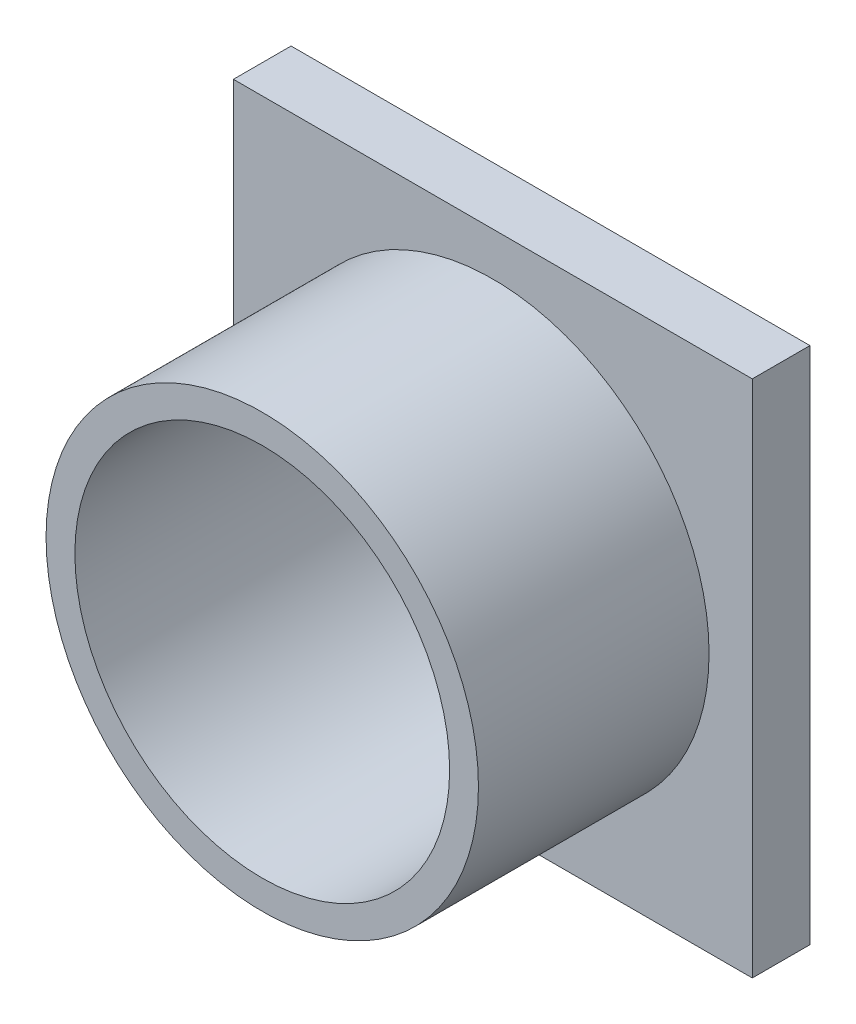
ISO-10303-21;
HEADER;
FILE_DESCRIPTION(('STEP AP214'),'2;1');
FILE_NAME('part.step','',(''),(''),'','','');
FILE_SCHEMA(('AUTOMOTIVE_DESIGN { 1 0 10303 214 1 1 1 1 }'));
ENDSEC;
DATA;
#1=APPLICATION_CONTEXT('core data for automotive mechanical design processes');
#2=APPLICATION_PROTOCOL_DEFINITION('international standard','automotive_design',2000,#1);
#3=PRODUCT_CONTEXT('',#1,'mechanical');
#4=PRODUCT('Part','Part','',(#3));
#5=PRODUCT_RELATED_PRODUCT_CATEGORY('part','',(#4));
#6=PRODUCT_DEFINITION_FORMATION('','',#4);
#7=PRODUCT_DEFINITION_CONTEXT('part definition',#1,'design');
#8=PRODUCT_DEFINITION('design','',#6,#7);
#9=PRODUCT_DEFINITION_SHAPE('','',#8);
#10=(LENGTH_UNIT() NAMED_UNIT(*) SI_UNIT(.MILLI.,.METRE.));
#11=(NAMED_UNIT(*) PLANE_ANGLE_UNIT() SI_UNIT($,.RADIAN.));
#12=(NAMED_UNIT(*) SI_UNIT($,.STERADIAN.) SOLID_ANGLE_UNIT());
#13=UNCERTAINTY_MEASURE_WITH_UNIT(LENGTH_MEASURE(1.E-05),#10,'distance_accuracy_value','');
#14=(GEOMETRIC_REPRESENTATION_CONTEXT(3) GLOBAL_UNCERTAINTY_ASSIGNED_CONTEXT((#13)) GLOBAL_UNIT_ASSIGNED_CONTEXT((#10,
#11,#12)) REPRESENTATION_CONTEXT('',''));
#15=CARTESIAN_POINT('',(0.,0.,0.));
#16=DIRECTION('',(0.,0.,1.));
#17=DIRECTION('',(1.,0.,0.));
#18=AXIS2_PLACEMENT_3D('',#15,#16,#17);
#19=CARTESIAN_POINT('',(0.,0.,0.));
#20=DIRECTION('',(0.,0.,1.));
#21=DIRECTION('',(1.,0.,0.));
#22=AXIS2_PLACEMENT_3D('',#19,#20,#21);
#23=PLANE('',#22);
#24=DIRECTION('',(-1.,0.,0.));
#25=VECTOR('',#24,1.);
#26=CARTESIAN_POINT('',(18.8,-18.8,0.));
#27=LINE('',#26,#25);
#28=CARTESIAN_POINT('',(18.8,-18.8,0.));
#29=VERTEX_POINT('',#28);
#30=CARTESIAN_POINT('',(14.,-18.8,0.));
#31=VERTEX_POINT('',#30);
#32=EDGE_CURVE('E227',#29,#31,#27,.T.);
#33=ORIENTED_EDGE('',*,*,#32,.F.);
#34=DIRECTION('',(0.,-1.,0.));
#35=VECTOR('',#34,1.);
#36=CARTESIAN_POINT('',(18.8,-18.8,0.));
#37=LINE('',#36,#35);
#38=CARTESIAN_POINT('',(18.8,-15.,0.));
#39=VERTEX_POINT('',#38);
#40=EDGE_CURVE('E217',#39,#29,#37,.T.);
#41=ORIENTED_EDGE('',*,*,#40,.F.);
#42=DIRECTION('',(1.,0.,0.));
#43=VECTOR('',#42,1.);
#44=CARTESIAN_POINT('',(18.8,-15.,0.));
#45=LINE('',#44,#43);
#46=CARTESIAN_POINT('',(14.,-15.,0.));
#47=VERTEX_POINT('',#46);
#48=EDGE_CURVE('E220',#47,#39,#45,.T.);
#49=ORIENTED_EDGE('',*,*,#48,.F.);
#50=DIRECTION('',(0.,1.,0.));
#51=VECTOR('',#50,1.);
#52=CARTESIAN_POINT('',(14.,-18.8,0.));
#53=LINE('',#52,#51);
#54=EDGE_CURVE('E224',#31,#47,#53,.T.);
#55=ORIENTED_EDGE('',*,*,#54,.F.);
#56=EDGE_LOOP('',(#33,#41,#49,#55));
#57=FACE_BOUND('',#56,.T.);
#58=DIRECTION('',(0.,1.,0.));
#59=VECTOR('',#58,1.);
#60=CARTESIAN_POINT('',(14.,18.8,0.));
#61=LINE('',#60,#59);
#62=CARTESIAN_POINT('',(14.,15.,0.));
#63=VERTEX_POINT('',#62);
#64=CARTESIAN_POINT('',(14.,18.8,0.));
#65=VERTEX_POINT('',#64);
#66=EDGE_CURVE('E263',#63,#65,#61,.T.);
#67=ORIENTED_EDGE('',*,*,#66,.F.);
#68=DIRECTION('',(-1.,0.,0.));
#69=VECTOR('',#68,1.);
#70=CARTESIAN_POINT('',(18.8,15.,0.));
#71=LINE('',#70,#69);
#72=CARTESIAN_POINT('',(18.8,15.,0.));
#73=VERTEX_POINT('',#72);
#74=EDGE_CURVE('E275',#73,#63,#71,.T.);
#75=ORIENTED_EDGE('',*,*,#74,.F.);
#76=DIRECTION('',(0.,-1.,0.));
#77=VECTOR('',#76,1.);
#78=CARTESIAN_POINT('',(18.8,18.8,0.));
#79=LINE('',#78,#77);
#80=CARTESIAN_POINT('',(18.8,18.8,0.));
#81=VERTEX_POINT('',#80);
#82=EDGE_CURVE('E287',#81,#73,#79,.T.);
#83=ORIENTED_EDGE('',*,*,#82,.F.);
#84=DIRECTION('',(1.,0.,0.));
#85=VECTOR('',#84,1.);
#86=CARTESIAN_POINT('',(18.8,18.8,0.));
#87=LINE('',#86,#85);
#88=EDGE_CURVE('E284',#65,#81,#87,.T.);
#89=ORIENTED_EDGE('',*,*,#88,.F.);
#90=EDGE_LOOP('',(#67,#75,#83,#89));
#91=FACE_BOUND('',#90,.T.);
#92=DIRECTION('',(0.,1.,0.));
#93=VECTOR('',#92,1.);
#94=CARTESIAN_POINT('',(22.5,22.5,0.));
#95=LINE('',#94,#93);
#96=CARTESIAN_POINT('',(22.5,-22.5,0.));
#97=VERTEX_POINT('',#96);
#98=CARTESIAN_POINT('',(22.5,22.5,0.));
#99=VERTEX_POINT('',#98);
#100=EDGE_CURVE('E315',#97,#99,#95,.T.);
#101=ORIENTED_EDGE('',*,*,#100,.F.);
#102=DIRECTION('',(1.,0.,0.));
#103=VECTOR('',#102,1.);
#104=CARTESIAN_POINT('',(-22.5,-22.5,0.));
#105=LINE('',#104,#103);
#106=CARTESIAN_POINT('',(-22.5,-22.5,0.));
#107=VERTEX_POINT('',#106);
#108=EDGE_CURVE('E320',#107,#97,#105,.T.);
#109=ORIENTED_EDGE('',*,*,#108,.F.);
#110=DIRECTION('',(0.,-1.,0.));
#111=VECTOR('',#110,1.);
#112=CARTESIAN_POINT('',(-22.5,22.5,0.));
#113=LINE('',#112,#111);
#114=CARTESIAN_POINT('',(-22.5,22.5,0.));
#115=VERTEX_POINT('',#114);
#116=EDGE_CURVE('E331',#115,#107,#113,.T.);
#117=ORIENTED_EDGE('',*,*,#116,.F.);
#118=DIRECTION('',(-1.,0.,0.));
#119=VECTOR('',#118,1.);
#120=CARTESIAN_POINT('',(-22.5,22.5,0.));
#121=LINE('',#120,#119);
#122=EDGE_CURVE('E329',#99,#115,#121,.T.);
#123=ORIENTED_EDGE('',*,*,#122,.F.);
#124=EDGE_LOOP('',(#101,#109,#117,#123));
#125=FACE_BOUND('',#124,.T.);
#126=CARTESIAN_POINT('',(0.,0.,0.));
#127=DIRECTION('',(0.,0.,1.));
#128=DIRECTION('',(1.,0.,0.));
#129=AXIS2_PLACEMENT_3D('',#126,#127,#128);
#130=CIRCLE('',#129,16.25);
#131=CARTESIAN_POINT('',(16.25,0.,0.));
#132=VERTEX_POINT('',#131);
#133=EDGE_CURVE('E310',#132,#132,#130,.T.);
#134=ORIENTED_EDGE('',*,*,#133,.T.);
#135=EDGE_LOOP('',(#134));
#136=FACE_BOUND('',#135,.T.);
#137=DIRECTION('',(1.,0.,0.));
#138=VECTOR('',#137,1.);
#139=CARTESIAN_POINT('',(-18.8,18.8,0.));
#140=LINE('',#139,#138);
#141=CARTESIAN_POINT('',(-18.8,18.8,0.));
#142=VERTEX_POINT('',#141);
#143=CARTESIAN_POINT('',(-14.,18.8,0.));
#144=VERTEX_POINT('',#143);
#145=EDGE_CURVE('E260',#142,#144,#140,.T.);
#146=ORIENTED_EDGE('',*,*,#145,.F.);
#147=DIRECTION('',(0.,1.,0.));
#148=VECTOR('',#147,1.);
#149=CARTESIAN_POINT('',(-18.8,18.8,0.));
#150=LINE('',#149,#148);
#151=CARTESIAN_POINT('',(-18.8,15.,0.));
#152=VERTEX_POINT('',#151);
#153=EDGE_CURVE('E250',#152,#142,#150,.T.);
#154=ORIENTED_EDGE('',*,*,#153,.F.);
#155=DIRECTION('',(-1.,0.,0.));
#156=VECTOR('',#155,1.);
#157=CARTESIAN_POINT('',(-18.8,15.,0.));
#158=LINE('',#157,#156);
#159=CARTESIAN_POINT('',(-14.,15.,0.));
#160=VERTEX_POINT('',#159);
#161=EDGE_CURVE('E253',#160,#152,#158,.T.);
#162=ORIENTED_EDGE('',*,*,#161,.F.);
#163=DIRECTION('',(0.,-1.,0.));
#164=VECTOR('',#163,1.);
#165=CARTESIAN_POINT('',(-14.,18.8,0.));
#166=LINE('',#165,#164);
#167=EDGE_CURVE('E257',#144,#160,#166,.T.);
#168=ORIENTED_EDGE('',*,*,#167,.F.);
#169=EDGE_LOOP('',(#146,#154,#162,#168));
#170=FACE_BOUND('',#169,.T.);
#171=DIRECTION('',(0.,1.,0.));
#172=VECTOR('',#171,1.);
#173=CARTESIAN_POINT('',(-18.8,-18.8,0.));
#174=LINE('',#173,#172);
#175=CARTESIAN_POINT('',(-18.8,-18.8,0.));
#176=VERTEX_POINT('',#175);
#177=CARTESIAN_POINT('',(-18.8,-15.,0.));
#178=VERTEX_POINT('',#177);
#179=EDGE_CURVE('E170',#176,#178,#174,.T.);
#180=ORIENTED_EDGE('',*,*,#179,.F.);
#181=DIRECTION('',(-1.,0.,0.));
#182=VECTOR('',#181,1.);
#183=CARTESIAN_POINT('',(-18.8,-18.8,0.));
#184=LINE('',#183,#182);
#185=CARTESIAN_POINT('',(-14.,-18.8,0.));
#186=VERTEX_POINT('',#185);
#187=EDGE_CURVE('E172',#186,#176,#184,.T.);
#188=ORIENTED_EDGE('',*,*,#187,.F.);
#189=DIRECTION('',(0.,-1.,0.));
#190=VECTOR('',#189,1.);
#191=CARTESIAN_POINT('',(-14.,-18.8,0.));
#192=LINE('',#191,#190);
#193=CARTESIAN_POINT('',(-14.,-15.,0.));
#194=VERTEX_POINT('',#193);
#195=EDGE_CURVE('E57',#194,#186,#192,.T.);
#196=ORIENTED_EDGE('',*,*,#195,.F.);
#197=DIRECTION('',(1.,0.,0.));
#198=VECTOR('',#197,1.);
#199=CARTESIAN_POINT('',(-18.8,-15.,0.));
#200=LINE('',#199,#198);
#201=EDGE_CURVE('E52',#178,#194,#200,.T.);
#202=ORIENTED_EDGE('',*,*,#201,.F.);
#203=EDGE_LOOP('',(#180,#188,#196,#202));
#204=FACE_BOUND('',#203,.T.);
#205=ADVANCED_FACE('F37',(#57,#91,#125,#136,#170,#204),#23,.F.);
#206=CARTESIAN_POINT('',(0.,0.,5.));
#207=DIRECTION('',(0.,0.,1.));
#208=DIRECTION('',(1.,0.,0.));
#209=AXIS2_PLACEMENT_3D('',#206,#207,#208);
#210=PLANE('',#209);
#211=DIRECTION('',(0.,1.,0.));
#212=VECTOR('',#211,1.);
#213=CARTESIAN_POINT('',(22.5,22.5,5.));
#214=LINE('',#213,#212);
#215=CARTESIAN_POINT('',(22.5,-22.5,5.));
#216=VERTEX_POINT('',#215);
#217=CARTESIAN_POINT('',(22.5,22.5,5.));
#218=VERTEX_POINT('',#217);
#219=EDGE_CURVE('E316',#216,#218,#214,.T.);
#220=ORIENTED_EDGE('',*,*,#219,.T.);
#221=DIRECTION('',(-1.,0.,0.));
#222=VECTOR('',#221,1.);
#223=CARTESIAN_POINT('',(-22.5,22.5,5.));
#224=LINE('',#223,#222);
#225=CARTESIAN_POINT('',(-22.5,22.5,5.));
#226=VERTEX_POINT('',#225);
#227=EDGE_CURVE('E319',#218,#226,#224,.T.);
#228=ORIENTED_EDGE('',*,*,#227,.T.);
#229=DIRECTION('',(0.,-1.,0.));
#230=VECTOR('',#229,1.);
#231=CARTESIAN_POINT('',(-22.5,22.5,5.));
#232=LINE('',#231,#230);
#233=CARTESIAN_POINT('',(-22.5,-22.5,5.));
#234=VERTEX_POINT('',#233);
#235=EDGE_CURVE('E322',#226,#234,#232,.T.);
#236=ORIENTED_EDGE('',*,*,#235,.T.);
#237=DIRECTION('',(1.,0.,0.));
#238=VECTOR('',#237,1.);
#239=CARTESIAN_POINT('',(-22.5,-22.5,5.));
#240=LINE('',#239,#238);
#241=EDGE_CURVE('E324',#234,#216,#240,.T.);
#242=ORIENTED_EDGE('',*,*,#241,.T.);
#243=EDGE_LOOP('',(#220,#228,#236,#242));
#244=FACE_BOUND('',#243,.T.);
#245=CARTESIAN_POINT('',(0.,0.,5.));
#246=DIRECTION('',(0.,0.,1.));
#247=DIRECTION('',(1.,0.,0.));
#248=AXIS2_PLACEMENT_3D('',#245,#246,#247);
#249=CIRCLE('',#248,18.75);
#250=CARTESIAN_POINT('',(18.75,0.,5.));
#251=VERTEX_POINT('',#250);
#252=EDGE_CURVE('E306',#251,#251,#249,.T.);
#253=ORIENTED_EDGE('',*,*,#252,.F.);
#254=EDGE_LOOP('',(#253));
#255=FACE_BOUND('',#254,.T.);
#256=ADVANCED_FACE('F358',(#244,#255),#210,.T.);
#257=CARTESIAN_POINT('',(22.5,22.5,5.));
#258=DIRECTION('',(-1.,0.,0.));
#259=DIRECTION('',(0.,-1.,0.));
#260=AXIS2_PLACEMENT_3D('',#257,#258,#259);
#261=PLANE('',#260);
#262=ORIENTED_EDGE('',*,*,#100,.T.);
#263=DIRECTION('',(0.,0.,-1.));
#264=VECTOR('',#263,1.);
#265=CARTESIAN_POINT('',(22.5,22.5,5.));
#266=LINE('',#265,#264);
#267=EDGE_CURVE('E11',#218,#99,#266,.T.);
#268=ORIENTED_EDGE('',*,*,#267,.F.);
#269=ORIENTED_EDGE('',*,*,#219,.F.);
#270=DIRECTION('',(0.,0.,-1.));
#271=VECTOR('',#270,1.);
#272=CARTESIAN_POINT('',(22.5,-22.5,5.));
#273=LINE('',#272,#271);
#274=EDGE_CURVE('E326',#216,#97,#273,.T.);
#275=ORIENTED_EDGE('',*,*,#274,.T.);
#276=EDGE_LOOP('',(#262,#268,#269,#275));
#277=FACE_BOUND('',#276,.T.);
#278=ADVANCED_FACE('F39',(#277),#261,.F.);
#279=CARTESIAN_POINT('',(-22.5,22.5,5.));
#280=DIRECTION('',(0.,-1.,0.));
#281=DIRECTION('',(0.,0.,-1.));
#282=AXIS2_PLACEMENT_3D('',#279,#280,#281);
#283=PLANE('',#282);
#284=ORIENTED_EDGE('',*,*,#122,.T.);
#285=DIRECTION('',(0.,0.,-1.));
#286=VECTOR('',#285,1.);
#287=CARTESIAN_POINT('',(-22.5,22.5,5.));
#288=LINE('',#287,#286);
#289=EDGE_CURVE('E45',#226,#115,#288,.T.);
#290=ORIENTED_EDGE('',*,*,#289,.F.);
#291=ORIENTED_EDGE('',*,*,#227,.F.);
#292=ORIENTED_EDGE('',*,*,#267,.T.);
#293=EDGE_LOOP('',(#284,#290,#291,#292));
#294=FACE_BOUND('',#293,.T.);
#295=ADVANCED_FACE('F360',(#294),#283,.F.);
#296=CARTESIAN_POINT('',(-22.5,22.5,5.));
#297=DIRECTION('',(1.,0.,0.));
#298=DIRECTION('',(0.,1.,0.));
#299=AXIS2_PLACEMENT_3D('',#296,#297,#298);
#300=PLANE('',#299);
#301=ORIENTED_EDGE('',*,*,#116,.T.);
#302=DIRECTION('',(0.,0.,-1.));
#303=VECTOR('',#302,1.);
#304=CARTESIAN_POINT('',(-22.5,-22.5,5.));
#305=LINE('',#304,#303);
#306=EDGE_CURVE('E336',#234,#107,#305,.T.);
#307=ORIENTED_EDGE('',*,*,#306,.F.);
#308=ORIENTED_EDGE('',*,*,#235,.F.);
#309=ORIENTED_EDGE('',*,*,#289,.T.);
#310=EDGE_LOOP('',(#301,#307,#308,#309));
#311=FACE_BOUND('',#310,.T.);
#312=ADVANCED_FACE('F343',(#311),#300,.F.);
#313=CARTESIAN_POINT('',(-22.5,-22.5,5.));
#314=DIRECTION('',(0.,1.,0.));
#315=DIRECTION('',(0.,0.,1.));
#316=AXIS2_PLACEMENT_3D('',#313,#314,#315);
#317=PLANE('',#316);
#318=ORIENTED_EDGE('',*,*,#108,.T.);
#319=ORIENTED_EDGE('',*,*,#274,.F.);
#320=ORIENTED_EDGE('',*,*,#241,.F.);
#321=ORIENTED_EDGE('',*,*,#306,.T.);
#322=EDGE_LOOP('',(#318,#319,#320,#321));
#323=FACE_BOUND('',#322,.T.);
#324=ADVANCED_FACE('F352',(#323),#317,.F.);
#325=CARTESIAN_POINT('',(0.,0.,5.));
#326=DIRECTION('',(0.,0.,-1.));
#327=DIRECTION('',(-1.,0.,0.));
#328=AXIS2_PLACEMENT_3D('',#325,#326,#327);
#329=CYLINDRICAL_SURFACE('',#328,16.25);
#330=ORIENTED_EDGE('',*,*,#133,.F.);
#331=EDGE_LOOP('',(#330));
#332=FACE_BOUND('',#331,.T.);
#333=CARTESIAN_POINT('',(0.,0.,25.));
#334=DIRECTION('',(0.,0.,1.));
#335=DIRECTION('',(1.,0.,0.));
#336=AXIS2_PLACEMENT_3D('',#333,#334,#335);
#337=CIRCLE('',#336,16.25);
#338=CARTESIAN_POINT('',(16.25,0.,25.));
#339=VERTEX_POINT('',#338);
#340=EDGE_CURVE('E303',#339,#339,#337,.T.);
#341=ORIENTED_EDGE('',*,*,#340,.T.);
#342=EDGE_LOOP('',(#341));
#343=FACE_BOUND('',#342,.T.);
#344=ADVANCED_FACE('F378',(#332,#343),#329,.F.);
#345=CARTESIAN_POINT('',(0.,0.,25.));
#346=DIRECTION('',(0.,0.,1.));
#347=DIRECTION('',(1.,0.,0.));
#348=AXIS2_PLACEMENT_3D('',#345,#346,#347);
#349=PLANE('',#348);
#350=CARTESIAN_POINT('',(0.,0.,25.));
#351=DIRECTION('',(0.,0.,1.));
#352=DIRECTION('',(1.,0.,0.));
#353=AXIS2_PLACEMENT_3D('',#350,#351,#352);
#354=CIRCLE('',#353,18.75);
#355=CARTESIAN_POINT('',(18.75,0.,25.));
#356=VERTEX_POINT('',#355);
#357=EDGE_CURVE('E307',#356,#356,#354,.T.);
#358=ORIENTED_EDGE('',*,*,#357,.T.);
#359=EDGE_LOOP('',(#358));
#360=FACE_BOUND('',#359,.T.);
#361=ORIENTED_EDGE('',*,*,#340,.F.);
#362=EDGE_LOOP('',(#361));
#363=FACE_BOUND('',#362,.T.);
#364=ADVANCED_FACE('F382',(#360,#363),#349,.T.);
#365=CARTESIAN_POINT('',(0.,0.,25.));
#366=DIRECTION('',(0.,0.,-1.));
#367=DIRECTION('',(-1.,0.,0.));
#368=AXIS2_PLACEMENT_3D('',#365,#366,#367);
#369=CYLINDRICAL_SURFACE('',#368,18.75);
#370=ORIENTED_EDGE('',*,*,#357,.F.);
#371=EDGE_LOOP('',(#370));
#372=FACE_BOUND('',#371,.T.);
#373=ORIENTED_EDGE('',*,*,#252,.T.);
#374=EDGE_LOOP('',(#373));
#375=FACE_BOUND('',#374,.T.);
#376=ADVANCED_FACE('F387',(#372,#375),#369,.T.);
#377=CARTESIAN_POINT('',(14.,18.8,-3.));
#378=DIRECTION('',(1.,0.,0.));
#379=DIRECTION('',(0.,0.,-1.));
#380=AXIS2_PLACEMENT_3D('',#377,#378,#379);
#381=PLANE('',#380);
#382=ORIENTED_EDGE('',*,*,#66,.T.);
#383=DIRECTION('',(0.,0.,1.));
#384=VECTOR('',#383,1.);
#385=CARTESIAN_POINT('',(14.,18.8,-3.));
#386=LINE('',#385,#384);
#387=CARTESIAN_POINT('',(14.,18.8,-3.));
#388=VERTEX_POINT('',#387);
#389=EDGE_CURVE('E300',#388,#65,#386,.T.);
#390=ORIENTED_EDGE('',*,*,#389,.F.);
#391=DIRECTION('',(0.,1.,0.));
#392=VECTOR('',#391,1.);
#393=CARTESIAN_POINT('',(14.,18.8,-3.));
#394=LINE('',#393,#392);
#395=CARTESIAN_POINT('',(14.,15.,-3.));
#396=VERTEX_POINT('',#395);
#397=EDGE_CURVE('E271',#396,#388,#394,.T.);
#398=ORIENTED_EDGE('',*,*,#397,.F.);
#399=DIRECTION('',(0.,0.,1.));
#400=VECTOR('',#399,1.);
#401=CARTESIAN_POINT('',(14.,15.,-3.));
#402=LINE('',#401,#400);
#403=EDGE_CURVE('E281',#396,#63,#402,.T.);
#404=ORIENTED_EDGE('',*,*,#403,.T.);
#405=EDGE_LOOP('',(#382,#390,#398,#404));
#406=FACE_BOUND('',#405,.T.);
#407=ADVANCED_FACE('F394',(#406),#381,.F.);
#408=CARTESIAN_POINT('',(18.8,18.8,-3.));
#409=DIRECTION('',(0.,-1.,0.));
#410=DIRECTION('',(0.,0.,-1.));
#411=AXIS2_PLACEMENT_3D('',#408,#409,#410);
#412=PLANE('',#411);
#413=ORIENTED_EDGE('',*,*,#88,.T.);
#414=DIRECTION('',(0.,0.,1.));
#415=VECTOR('',#414,1.);
#416=CARTESIAN_POINT('',(18.8,18.8,-3.));
#417=LINE('',#416,#415);
#418=CARTESIAN_POINT('',(18.8,18.8,-3.));
#419=VERTEX_POINT('',#418);
#420=EDGE_CURVE('E297',#419,#81,#417,.T.);
#421=ORIENTED_EDGE('',*,*,#420,.F.);
#422=DIRECTION('',(1.,0.,0.));
#423=VECTOR('',#422,1.);
#424=CARTESIAN_POINT('',(18.8,18.8,-3.));
#425=LINE('',#424,#423);
#426=EDGE_CURVE('E274',#388,#419,#425,.T.);
#427=ORIENTED_EDGE('',*,*,#426,.F.);
#428=ORIENTED_EDGE('',*,*,#389,.T.);
#429=EDGE_LOOP('',(#413,#421,#427,#428));
#430=FACE_BOUND('',#429,.T.);
#431=ADVANCED_FACE('F399',(#430),#412,.F.);
#432=CARTESIAN_POINT('',(18.8,18.8,-3.));
#433=DIRECTION('',(-1.,0.,0.));
#434=DIRECTION('',(0.,0.,1.));
#435=AXIS2_PLACEMENT_3D('',#432,#433,#434);
#436=PLANE('',#435);
#437=ORIENTED_EDGE('',*,*,#82,.T.);
#438=DIRECTION('',(0.,0.,1.));
#439=VECTOR('',#438,1.);
#440=CARTESIAN_POINT('',(18.8,15.,-3.));
#441=LINE('',#440,#439);
#442=CARTESIAN_POINT('',(18.8,15.,-3.));
#443=VERTEX_POINT('',#442);
#444=EDGE_CURVE('E294',#443,#73,#441,.T.);
#445=ORIENTED_EDGE('',*,*,#444,.F.);
#446=DIRECTION('',(0.,-1.,0.));
#447=VECTOR('',#446,1.);
#448=CARTESIAN_POINT('',(18.8,18.8,-3.));
#449=LINE('',#448,#447);
#450=EDGE_CURVE('E277',#419,#443,#449,.T.);
#451=ORIENTED_EDGE('',*,*,#450,.F.);
#452=ORIENTED_EDGE('',*,*,#420,.T.);
#453=EDGE_LOOP('',(#437,#445,#451,#452));
#454=FACE_BOUND('',#453,.T.);
#455=ADVANCED_FACE('F403',(#454),#436,.F.);
#456=CARTESIAN_POINT('',(18.8,15.,-3.));
#457=DIRECTION('',(0.,1.,0.));
#458=DIRECTION('',(-1.,0.,0.));
#459=AXIS2_PLACEMENT_3D('',#456,#457,#458);
#460=PLANE('',#459);
#461=ORIENTED_EDGE('',*,*,#74,.T.);
#462=ORIENTED_EDGE('',*,*,#403,.F.);
#463=DIRECTION('',(-1.,0.,0.));
#464=VECTOR('',#463,1.);
#465=CARTESIAN_POINT('',(18.8,15.,-3.));
#466=LINE('',#465,#464);
#467=EDGE_CURVE('E279',#443,#396,#466,.T.);
#468=ORIENTED_EDGE('',*,*,#467,.F.);
#469=ORIENTED_EDGE('',*,*,#444,.T.);
#470=EDGE_LOOP('',(#461,#462,#468,#469));
#471=FACE_BOUND('',#470,.T.);
#472=ADVANCED_FACE('F407',(#471),#460,.F.);
#473=CARTESIAN_POINT('',(0.,0.,-3.));
#474=DIRECTION('',(0.,0.,-1.));
#475=DIRECTION('',(-1.,0.,0.));
#476=AXIS2_PLACEMENT_3D('',#473,#474,#475);
#477=PLANE('',#476);
#478=ORIENTED_EDGE('',*,*,#397,.T.);
#479=ORIENTED_EDGE('',*,*,#426,.T.);
#480=ORIENTED_EDGE('',*,*,#450,.T.);
#481=ORIENTED_EDGE('',*,*,#467,.T.);
#482=EDGE_LOOP('',(#478,#479,#480,#481));
#483=FACE_BOUND('',#482,.T.);
#484=ADVANCED_FACE('F411',(#483),#477,.T.);
#485=CARTESIAN_POINT('',(-18.8,18.8,-3.));
#486=DIRECTION('',(0.,-1.,0.));
#487=DIRECTION('',(0.,0.,-1.));
#488=AXIS2_PLACEMENT_3D('',#485,#486,#487);
#489=PLANE('',#488);
#490=ORIENTED_EDGE('',*,*,#145,.T.);
#491=DIRECTION('',(0.,0.,1.));
#492=VECTOR('',#491,1.);
#493=CARTESIAN_POINT('',(-14.,18.8,-3.));
#494=LINE('',#493,#492);
#495=CARTESIAN_POINT('',(-14.,18.8,-3.));
#496=VERTEX_POINT('',#495);
#497=EDGE_CURVE('E230',#496,#144,#494,.T.);
#498=ORIENTED_EDGE('',*,*,#497,.F.);
#499=DIRECTION('',(1.,0.,0.));
#500=VECTOR('',#499,1.);
#501=CARTESIAN_POINT('',(-18.8,18.8,-3.));
#502=LINE('',#501,#500);
#503=CARTESIAN_POINT('',(-18.8,18.8,-3.));
#504=VERTEX_POINT('',#503);
#505=EDGE_CURVE('E254',#504,#496,#502,.T.);
#506=ORIENTED_EDGE('',*,*,#505,.F.);
#507=DIRECTION('',(0.,0.,1.));
#508=VECTOR('',#507,1.);
#509=CARTESIAN_POINT('',(-18.8,18.8,-3.));
#510=LINE('',#509,#508);
#511=EDGE_CURVE('E246',#504,#142,#510,.T.);
#512=ORIENTED_EDGE('',*,*,#511,.T.);
#513=EDGE_LOOP('',(#490,#498,#506,#512));
#514=FACE_BOUND('',#513,.T.);
#515=ADVANCED_FACE('F415',(#514),#489,.F.);
#516=CARTESIAN_POINT('',(-14.,18.8,-3.));
#517=DIRECTION('',(-1.,0.,0.));
#518=DIRECTION('',(0.,-1.,0.));
#519=AXIS2_PLACEMENT_3D('',#516,#517,#518);
#520=PLANE('',#519);
#521=ORIENTED_EDGE('',*,*,#167,.T.);
#522=DIRECTION('',(0.,0.,1.));
#523=VECTOR('',#522,1.);
#524=CARTESIAN_POINT('',(-14.,15.,-3.));
#525=LINE('',#524,#523);
#526=CARTESIAN_POINT('',(-14.,15.,-3.));
#527=VERTEX_POINT('',#526);
#528=EDGE_CURVE('E240',#527,#160,#525,.T.);
#529=ORIENTED_EDGE('',*,*,#528,.F.);
#530=DIRECTION('',(0.,-1.,0.));
#531=VECTOR('',#530,1.);
#532=CARTESIAN_POINT('',(-14.,18.8,-3.));
#533=LINE('',#532,#531);
#534=EDGE_CURVE('E267',#496,#527,#533,.T.);
#535=ORIENTED_EDGE('',*,*,#534,.F.);
#536=ORIENTED_EDGE('',*,*,#497,.T.);
#537=EDGE_LOOP('',(#521,#529,#535,#536));
#538=FACE_BOUND('',#537,.T.);
#539=ADVANCED_FACE('F429',(#538),#520,.F.);
#540=CARTESIAN_POINT('',(-18.8,15.,-3.));
#541=DIRECTION('',(0.,1.,0.));
#542=DIRECTION('',(-1.,0.,0.));
#543=AXIS2_PLACEMENT_3D('',#540,#541,#542);
#544=PLANE('',#543);
#545=ORIENTED_EDGE('',*,*,#161,.T.);
#546=DIRECTION('',(0.,0.,1.));
#547=VECTOR('',#546,1.);
#548=CARTESIAN_POINT('',(-18.8,15.,-3.));
#549=LINE('',#548,#547);
#550=CARTESIAN_POINT('',(-18.8,15.,-3.));
#551=VERTEX_POINT('',#550);
#552=EDGE_CURVE('E243',#551,#152,#549,.T.);
#553=ORIENTED_EDGE('',*,*,#552,.F.);
#554=DIRECTION('',(-1.,0.,0.));
#555=VECTOR('',#554,1.);
#556=CARTESIAN_POINT('',(-18.8,15.,-3.));
#557=LINE('',#556,#555);
#558=EDGE_CURVE('E265',#527,#551,#557,.T.);
#559=ORIENTED_EDGE('',*,*,#558,.F.);
#560=ORIENTED_EDGE('',*,*,#528,.T.);
#561=EDGE_LOOP('',(#545,#553,#559,#560));
#562=FACE_BOUND('',#561,.T.);
#563=ADVANCED_FACE('F425',(#562),#544,.F.);
#564=CARTESIAN_POINT('',(-18.8,18.8,-3.));
#565=DIRECTION('',(1.,0.,0.));
#566=DIRECTION('',(0.,0.,-1.));
#567=AXIS2_PLACEMENT_3D('',#564,#565,#566);
#568=PLANE('',#567);
#569=ORIENTED_EDGE('',*,*,#153,.T.);
#570=ORIENTED_EDGE('',*,*,#511,.F.);
#571=DIRECTION('',(0.,1.,0.));
#572=VECTOR('',#571,1.);
#573=CARTESIAN_POINT('',(-18.8,18.8,-3.));
#574=LINE('',#573,#572);
#575=EDGE_CURVE('E249',#551,#504,#574,.T.);
#576=ORIENTED_EDGE('',*,*,#575,.F.);
#577=ORIENTED_EDGE('',*,*,#552,.T.);
#578=EDGE_LOOP('',(#569,#570,#576,#577));
#579=FACE_BOUND('',#578,.T.);
#580=ADVANCED_FACE('F421',(#579),#568,.F.);
#581=CARTESIAN_POINT('',(0.,0.,-3.));
#582=DIRECTION('',(0.,0.,-1.));
#583=DIRECTION('',(-1.,0.,0.));
#584=AXIS2_PLACEMENT_3D('',#581,#582,#583);
#585=PLANE('',#584);
#586=ORIENTED_EDGE('',*,*,#505,.T.);
#587=ORIENTED_EDGE('',*,*,#534,.T.);
#588=ORIENTED_EDGE('',*,*,#558,.T.);
#589=ORIENTED_EDGE('',*,*,#575,.T.);
#590=EDGE_LOOP('',(#586,#587,#588,#589));
#591=FACE_BOUND('',#590,.T.);
#592=ADVANCED_FACE('F417',(#591),#585,.T.);
#593=CARTESIAN_POINT('',(18.8,-18.8,-3.));
#594=DIRECTION('',(0.,1.,0.));
#595=DIRECTION('',(0.,0.,1.));
#596=AXIS2_PLACEMENT_3D('',#593,#594,#595);
#597=PLANE('',#596);
#598=ORIENTED_EDGE('',*,*,#32,.T.);
#599=DIRECTION('',(0.,0.,1.));
#600=VECTOR('',#599,1.);
#601=CARTESIAN_POINT('',(14.,-18.8,-3.));
#602=LINE('',#601,#600);
#603=CARTESIAN_POINT('',(14.,-18.8,-3.));
#604=VERTEX_POINT('',#603);
#605=EDGE_CURVE('E176',#604,#31,#602,.T.);
#606=ORIENTED_EDGE('',*,*,#605,.F.);
#607=DIRECTION('',(-1.,0.,0.));
#608=VECTOR('',#607,1.);
#609=CARTESIAN_POINT('',(18.8,-18.8,-3.));
#610=LINE('',#609,#608);
#611=CARTESIAN_POINT('',(18.8,-18.8,-3.));
#612=VERTEX_POINT('',#611);
#613=EDGE_CURVE('E221',#612,#604,#610,.T.);
#614=ORIENTED_EDGE('',*,*,#613,.F.);
#615=DIRECTION('',(0.,0.,1.));
#616=VECTOR('',#615,1.);
#617=CARTESIAN_POINT('',(18.8,-18.8,-3.));
#618=LINE('',#617,#616);
#619=EDGE_CURVE('E213',#612,#29,#618,.T.);
#620=ORIENTED_EDGE('',*,*,#619,.T.);
#621=EDGE_LOOP('',(#598,#606,#614,#620));
#622=FACE_BOUND('',#621,.T.);
#623=ADVANCED_FACE('F420',(#622),#597,.F.);
#624=CARTESIAN_POINT('',(14.,-18.8,-3.));
#625=DIRECTION('',(1.,0.,0.));
#626=DIRECTION('',(0.,1.,0.));
#627=AXIS2_PLACEMENT_3D('',#624,#625,#626);
#628=PLANE('',#627);
#629=ORIENTED_EDGE('',*,*,#54,.T.);
#630=DIRECTION('',(0.,0.,1.));
#631=VECTOR('',#630,1.);
#632=CARTESIAN_POINT('',(14.,-15.,-3.));
#633=LINE('',#632,#631);
#634=CARTESIAN_POINT('',(14.,-15.,-3.));
#635=VERTEX_POINT('',#634);
#636=EDGE_CURVE('E207',#635,#47,#633,.T.);
#637=ORIENTED_EDGE('',*,*,#636,.F.);
#638=DIRECTION('',(0.,1.,0.));
#639=VECTOR('',#638,1.);
#640=CARTESIAN_POINT('',(14.,-18.8,-3.));
#641=LINE('',#640,#639);
#642=EDGE_CURVE('E234',#604,#635,#641,.T.);
#643=ORIENTED_EDGE('',*,*,#642,.F.);
#644=ORIENTED_EDGE('',*,*,#605,.T.);
#645=EDGE_LOOP('',(#629,#637,#643,#644));
#646=FACE_BOUND('',#645,.T.);
#647=ADVANCED_FACE('F448',(#646),#628,.F.);
#648=CARTESIAN_POINT('',(18.8,-15.,-3.));
#649=DIRECTION('',(0.,-1.,0.));
#650=DIRECTION('',(1.,0.,0.));
#651=AXIS2_PLACEMENT_3D('',#648,#649,#650);
#652=PLANE('',#651);
#653=ORIENTED_EDGE('',*,*,#48,.T.);
#654=DIRECTION('',(0.,0.,1.));
#655=VECTOR('',#654,1.);
#656=CARTESIAN_POINT('',(18.8,-15.,-3.));
#657=LINE('',#656,#655);
#658=CARTESIAN_POINT('',(18.8,-15.,-3.));
#659=VERTEX_POINT('',#658);
#660=EDGE_CURVE('E210',#659,#39,#657,.T.);
#661=ORIENTED_EDGE('',*,*,#660,.F.);
#662=DIRECTION('',(1.,0.,0.));
#663=VECTOR('',#662,1.);
#664=CARTESIAN_POINT('',(18.8,-15.,-3.));
#665=LINE('',#664,#663);
#666=EDGE_CURVE('E232',#635,#659,#665,.T.);
#667=ORIENTED_EDGE('',*,*,#666,.F.);
#668=ORIENTED_EDGE('',*,*,#636,.T.);
#669=EDGE_LOOP('',(#653,#661,#667,#668));
#670=FACE_BOUND('',#669,.T.);
#671=ADVANCED_FACE('F444',(#670),#652,.F.);
#672=CARTESIAN_POINT('',(18.8,-18.8,-3.));
#673=DIRECTION('',(-1.,0.,0.));
#674=DIRECTION('',(0.,0.,1.));
#675=AXIS2_PLACEMENT_3D('',#672,#673,#674);
#676=PLANE('',#675);
#677=ORIENTED_EDGE('',*,*,#40,.T.);
#678=ORIENTED_EDGE('',*,*,#619,.F.);
#679=DIRECTION('',(0.,-1.,0.));
#680=VECTOR('',#679,1.);
#681=CARTESIAN_POINT('',(18.8,-18.8,-3.));
#682=LINE('',#681,#680);
#683=EDGE_CURVE('E216',#659,#612,#682,.T.);
#684=ORIENTED_EDGE('',*,*,#683,.F.);
#685=ORIENTED_EDGE('',*,*,#660,.T.);
#686=EDGE_LOOP('',(#677,#678,#684,#685));
#687=FACE_BOUND('',#686,.T.);
#688=ADVANCED_FACE('F440',(#687),#676,.F.);
#689=CARTESIAN_POINT('',(0.,0.,-3.));
#690=DIRECTION('',(0.,0.,-1.));
#691=DIRECTION('',(-1.,0.,0.));
#692=AXIS2_PLACEMENT_3D('',#689,#690,#691);
#693=PLANE('',#692);
#694=ORIENTED_EDGE('',*,*,#613,.T.);
#695=ORIENTED_EDGE('',*,*,#642,.T.);
#696=ORIENTED_EDGE('',*,*,#666,.T.);
#697=ORIENTED_EDGE('',*,*,#683,.T.);
#698=EDGE_LOOP('',(#694,#695,#696,#697));
#699=FACE_BOUND('',#698,.T.);
#700=ADVANCED_FACE('F437',(#699),#693,.T.);
#701=CARTESIAN_POINT('',(-18.8,-18.8,-3.));
#702=DIRECTION('',(1.,0.,0.));
#703=DIRECTION('',(0.,0.,-1.));
#704=AXIS2_PLACEMENT_3D('',#701,#702,#703);
#705=PLANE('',#704);
#706=ORIENTED_EDGE('',*,*,#179,.T.);
#707=DIRECTION('',(0.,0.,1.));
#708=VECTOR('',#707,1.);
#709=CARTESIAN_POINT('',(-18.8,-15.,-3.));
#710=LINE('',#709,#708);
#711=CARTESIAN_POINT('',(-18.8,-15.,-3.));
#712=VERTEX_POINT('',#711);
#713=EDGE_CURVE('E701',#712,#178,#710,.T.);
#714=ORIENTED_EDGE('',*,*,#713,.F.);
#715=DIRECTION('',(0.,1.,0.));
#716=VECTOR('',#715,1.);
#717=CARTESIAN_POINT('',(-18.8,-18.8,-3.));
#718=LINE('',#717,#716);
#719=CARTESIAN_POINT('',(-18.8,-18.8,-3.));
#720=VERTEX_POINT('',#719);
#721=EDGE_CURVE('E187',#720,#712,#718,.T.);
#722=ORIENTED_EDGE('',*,*,#721,.F.);
#723=DIRECTION('',(0.,0.,1.));
#724=VECTOR('',#723,1.);
#725=CARTESIAN_POINT('',(-18.8,-18.8,-3.));
#726=LINE('',#725,#724);
#727=EDGE_CURVE('E183',#720,#176,#726,.T.);
#728=ORIENTED_EDGE('',*,*,#727,.T.);
#729=EDGE_LOOP('',(#706,#714,#722,#728));
#730=FACE_BOUND('',#729,.T.);
#731=ADVANCED_FACE('F189',(#730),#705,.F.);
#732=CARTESIAN_POINT('',(-18.8,-15.,-3.));
#733=DIRECTION('',(0.,-1.,0.));
#734=DIRECTION('',(1.,0.,0.));
#735=AXIS2_PLACEMENT_3D('',#732,#733,#734);
#736=PLANE('',#735);
#737=ORIENTED_EDGE('',*,*,#201,.T.);
#738=DIRECTION('',(0.,0.,1.));
#739=VECTOR('',#738,1.);
#740=CARTESIAN_POINT('',(-14.,-15.,-3.));
#741=LINE('',#740,#739);
#742=CARTESIAN_POINT('',(-14.,-15.,-3.));
#743=VERTEX_POINT('',#742);
#744=EDGE_CURVE('E195',#743,#194,#741,.T.);
#745=ORIENTED_EDGE('',*,*,#744,.F.);
#746=DIRECTION('',(1.,0.,0.));
#747=VECTOR('',#746,1.);
#748=CARTESIAN_POINT('',(-18.8,-15.,-3.));
#749=LINE('',#748,#747);
#750=EDGE_CURVE('E202',#712,#743,#749,.T.);
#751=ORIENTED_EDGE('',*,*,#750,.F.);
#752=ORIENTED_EDGE('',*,*,#713,.T.);
#753=EDGE_LOOP('',(#737,#745,#751,#752));
#754=FACE_BOUND('',#753,.T.);
#755=ADVANCED_FACE('F465',(#754),#736,.F.);
#756=CARTESIAN_POINT('',(-14.,-18.8,-3.));
#757=DIRECTION('',(-1.,0.,0.));
#758=DIRECTION('',(0.,-1.,0.));
#759=AXIS2_PLACEMENT_3D('',#756,#757,#758);
#760=PLANE('',#759);
#761=ORIENTED_EDGE('',*,*,#195,.T.);
#762=DIRECTION('',(0.,0.,1.));
#763=VECTOR('',#762,1.);
#764=CARTESIAN_POINT('',(-14.,-18.8,-3.));
#765=LINE('',#764,#763);
#766=CARTESIAN_POINT('',(-14.,-18.8,-3.));
#767=VERTEX_POINT('',#766);
#768=EDGE_CURVE('E186',#767,#186,#765,.T.);
#769=ORIENTED_EDGE('',*,*,#768,.F.);
#770=DIRECTION('',(0.,-1.,0.));
#771=VECTOR('',#770,1.);
#772=CARTESIAN_POINT('',(-14.,-18.8,-3.));
#773=LINE('',#772,#771);
#774=EDGE_CURVE('E193',#743,#767,#773,.T.);
#775=ORIENTED_EDGE('',*,*,#774,.F.);
#776=ORIENTED_EDGE('',*,*,#744,.T.);
#777=EDGE_LOOP('',(#761,#769,#775,#776));
#778=FACE_BOUND('',#777,.T.);
#779=ADVANCED_FACE('F462',(#778),#760,.F.);
#780=CARTESIAN_POINT('',(-18.8,-18.8,-3.));
#781=DIRECTION('',(0.,1.,0.));
#782=DIRECTION('',(0.,0.,1.));
#783=AXIS2_PLACEMENT_3D('',#780,#781,#782);
#784=PLANE('',#783);
#785=ORIENTED_EDGE('',*,*,#187,.T.);
#786=ORIENTED_EDGE('',*,*,#727,.F.);
#787=DIRECTION('',(-1.,0.,0.));
#788=VECTOR('',#787,1.);
#789=CARTESIAN_POINT('',(-18.8,-18.8,-3.));
#790=LINE('',#789,#788);
#791=EDGE_CURVE('E191',#767,#720,#790,.T.);
#792=ORIENTED_EDGE('',*,*,#791,.F.);
#793=ORIENTED_EDGE('',*,*,#768,.T.);
#794=EDGE_LOOP('',(#785,#786,#792,#793));
#795=FACE_BOUND('',#794,.T.);
#796=ADVANCED_FACE('F181',(#795),#784,.F.);
#797=CARTESIAN_POINT('',(0.,0.,-3.));
#798=DIRECTION('',(0.,0.,-1.));
#799=DIRECTION('',(-1.,0.,0.));
#800=AXIS2_PLACEMENT_3D('',#797,#798,#799);
#801=PLANE('',#800);
#802=ORIENTED_EDGE('',*,*,#721,.T.);
#803=ORIENTED_EDGE('',*,*,#750,.T.);
#804=ORIENTED_EDGE('',*,*,#774,.T.);
#805=ORIENTED_EDGE('',*,*,#791,.T.);
#806=EDGE_LOOP('',(#802,#803,#804,#805));
#807=FACE_BOUND('',#806,.T.);
#808=ADVANCED_FACE('F456',(#807),#801,.T.);
#809=CLOSED_SHELL('',(#205,#256,#278,#295,#312,#324,#344,#364,#376,#407,#431,#455,#472,#484,
#515,#539,#563,#580,#592,#623,#647,#671,#688,#700,#731,#755,#779,#796,#808));
#810=MANIFOLD_SOLID_BREP('B2',#809);
#811=ADVANCED_BREP_SHAPE_REPRESENTATION('',(#18,#810),#14);
#812=SHAPE_DEFINITION_REPRESENTATION(#9,#811);
ENDSEC;
END-ISO-10303-21;
